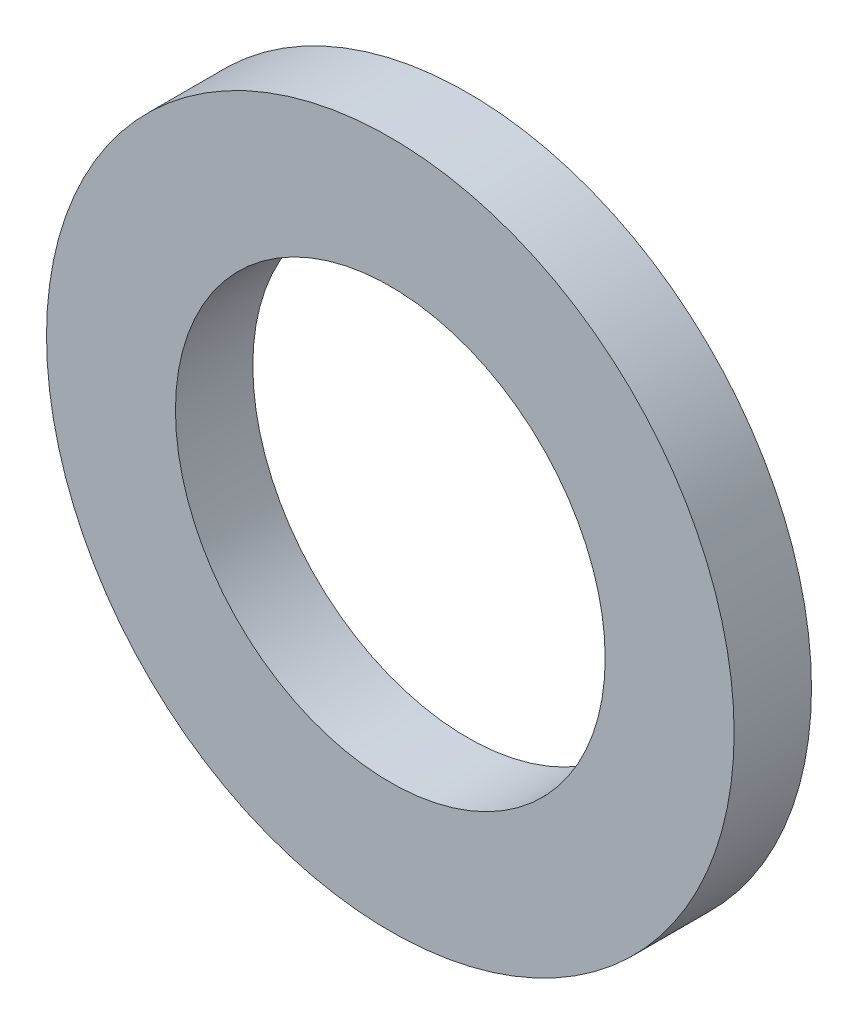
ISO-10303-21;
HEADER;
FILE_DESCRIPTION(('STEP AP214'),'2;1');
FILE_NAME('part.step','',(''),(''),'','','');
FILE_SCHEMA(('AUTOMOTIVE_DESIGN { 1 0 10303 214 1 1 1 1 }'));
ENDSEC;
DATA;
#1=APPLICATION_CONTEXT('core data for automotive mechanical design processes');
#2=APPLICATION_PROTOCOL_DEFINITION('international standard','automotive_design',2000,#1);
#3=PRODUCT_CONTEXT('',#1,'mechanical');
#4=PRODUCT('Part','Part','',(#3));
#5=PRODUCT_RELATED_PRODUCT_CATEGORY('part','',(#4));
#6=PRODUCT_DEFINITION_FORMATION('','',#4);
#7=PRODUCT_DEFINITION_CONTEXT('part definition',#1,'design');
#8=PRODUCT_DEFINITION('design','',#6,#7);
#9=PRODUCT_DEFINITION_SHAPE('','',#8);
#10=(LENGTH_UNIT() NAMED_UNIT(*) SI_UNIT(.MILLI.,.METRE.));
#11=(NAMED_UNIT(*) PLANE_ANGLE_UNIT() SI_UNIT($,.RADIAN.));
#12=(NAMED_UNIT(*) SI_UNIT($,.STERADIAN.) SOLID_ANGLE_UNIT());
#13=UNCERTAINTY_MEASURE_WITH_UNIT(LENGTH_MEASURE(1.E-05),#10,'distance_accuracy_value','');
#14=(GEOMETRIC_REPRESENTATION_CONTEXT(3) GLOBAL_UNCERTAINTY_ASSIGNED_CONTEXT((#13)) GLOBAL_UNIT_ASSIGNED_CONTEXT((#10,
#11,#12)) REPRESENTATION_CONTEXT('',''));
#15=CARTESIAN_POINT('',(0.,0.,0.));
#16=DIRECTION('',(0.,0.,1.));
#17=DIRECTION('',(1.,0.,0.));
#18=AXIS2_PLACEMENT_3D('',#15,#16,#17);
#19=CARTESIAN_POINT('',(0.,0.,1.35));
#20=DIRECTION('',(0.,0.,1.));
#21=DIRECTION('',(1.,0.,0.));
#22=AXIS2_PLACEMENT_3D('',#19,#20,#21);
#23=PLANE('',#22);
#24=CARTESIAN_POINT('',(0.,0.,1.35));
#25=DIRECTION('',(0.,0.,1.));
#26=DIRECTION('',(1.,0.,0.));
#27=AXIS2_PLACEMENT_3D('',#24,#25,#26);
#28=CIRCLE('',#27,12.);
#29=CARTESIAN_POINT('',(12.,0.,1.35));
#30=VERTEX_POINT('',#29);
#31=EDGE_CURVE('E10',#30,#30,#28,.T.);
#32=ORIENTED_EDGE('',*,*,#31,.T.);
#33=EDGE_LOOP('',(#32));
#34=FACE_BOUND('',#33,.T.);
#35=CARTESIAN_POINT('',(0.,0.,1.35));
#36=DIRECTION('',(0.,0.,1.));
#37=DIRECTION('',(1.,0.,0.));
#38=AXIS2_PLACEMENT_3D('',#35,#36,#37);
#39=CIRCLE('',#38,7.5);
#40=CARTESIAN_POINT('',(7.5,0.,1.35));
#41=VERTEX_POINT('',#40);
#42=EDGE_CURVE('E37',#41,#41,#39,.T.);
#43=ORIENTED_EDGE('',*,*,#42,.F.);
#44=EDGE_LOOP('',(#43));
#45=FACE_BOUND('',#44,.T.);
#46=ADVANCED_FACE('F30',(#34,#45),#23,.T.);
#47=CARTESIAN_POINT('',(0.,0.,1.35));
#48=DIRECTION('',(0.,0.,-1.));
#49=DIRECTION('',(-1.,0.,0.));
#50=AXIS2_PLACEMENT_3D('',#47,#48,#49);
#51=CYLINDRICAL_SURFACE('',#50,12.);
#52=ORIENTED_EDGE('',*,*,#31,.F.);
#53=EDGE_LOOP('',(#52));
#54=FACE_BOUND('',#53,.T.);
#55=CARTESIAN_POINT('',(0.,0.,-1.35));
#56=DIRECTION('',(0.,0.,1.));
#57=DIRECTION('',(1.,0.,0.));
#58=AXIS2_PLACEMENT_3D('',#55,#56,#57);
#59=CIRCLE('',#58,12.);
#60=CARTESIAN_POINT('',(12.,0.,-1.35));
#61=VERTEX_POINT('',#60);
#62=EDGE_CURVE('E41',#61,#61,#59,.T.);
#63=ORIENTED_EDGE('',*,*,#62,.T.);
#64=EDGE_LOOP('',(#63));
#65=FACE_BOUND('',#64,.T.);
#66=ADVANCED_FACE('F32',(#54,#65),#51,.T.);
#67=CARTESIAN_POINT('',(0.,0.,1.35));
#68=DIRECTION('',(0.,0.,-1.));
#69=DIRECTION('',(-1.,0.,0.));
#70=AXIS2_PLACEMENT_3D('',#67,#68,#69);
#71=CYLINDRICAL_SURFACE('',#70,7.5);
#72=ORIENTED_EDGE('',*,*,#42,.T.);
#73=EDGE_LOOP('',(#72));
#74=FACE_BOUND('',#73,.T.);
#75=CARTESIAN_POINT('',(0.,0.,-1.35));
#76=DIRECTION('',(0.,0.,1.));
#77=DIRECTION('',(1.,0.,0.));
#78=AXIS2_PLACEMENT_3D('',#75,#76,#77);
#79=CIRCLE('',#78,7.5);
#80=CARTESIAN_POINT('',(7.5,0.,-1.35));
#81=VERTEX_POINT('',#80);
#82=EDGE_CURVE('E45',#81,#81,#79,.T.);
#83=ORIENTED_EDGE('',*,*,#82,.F.);
#84=EDGE_LOOP('',(#83));
#85=FACE_BOUND('',#84,.T.);
#86=ADVANCED_FACE('F54',(#74,#85),#71,.F.);
#87=CARTESIAN_POINT('',(0.,0.,-1.35));
#88=DIRECTION('',(0.,0.,1.));
#89=DIRECTION('',(1.,0.,0.));
#90=AXIS2_PLACEMENT_3D('',#87,#88,#89);
#91=PLANE('',#90);
#92=ORIENTED_EDGE('',*,*,#82,.T.);
#93=EDGE_LOOP('',(#92));
#94=FACE_BOUND('',#93,.T.);
#95=ORIENTED_EDGE('',*,*,#62,.F.);
#96=EDGE_LOOP('',(#95));
#97=FACE_BOUND('',#96,.T.);
#98=ADVANCED_FACE('F51',(#94,#97),#91,.F.);
#99=CLOSED_SHELL('',(#46,#66,#86,#98));
#100=MANIFOLD_SOLID_BREP('B2',#99);
#101=ADVANCED_BREP_SHAPE_REPRESENTATION('',(#18,#100),#14);
#102=SHAPE_DEFINITION_REPRESENTATION(#9,#101);
ENDSEC;
END-ISO-10303-21;
